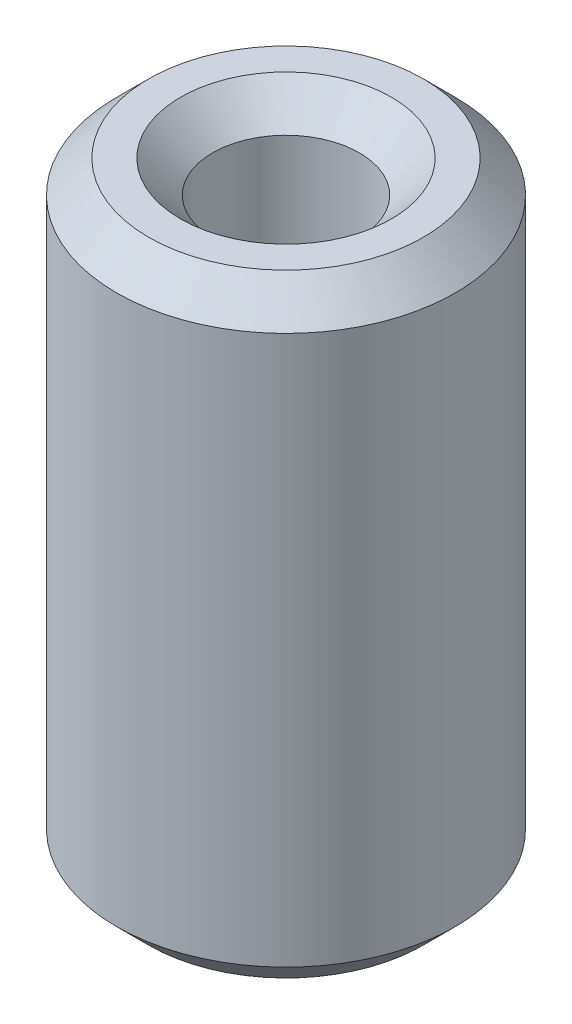
ISO-10303-21;
HEADER;
FILE_DESCRIPTION(('STEP AP214'),'2;1');
FILE_NAME('part.step','',(''),(''),'','','');
FILE_SCHEMA(('AUTOMOTIVE_DESIGN { 1 0 10303 214 1 1 1 1 }'));
ENDSEC;
DATA;
#1=APPLICATION_CONTEXT('core data for automotive mechanical design processes');
#2=APPLICATION_PROTOCOL_DEFINITION('international standard','automotive_design',2000,#1);
#3=PRODUCT_CONTEXT('',#1,'mechanical');
#4=PRODUCT('Part','Part','',(#3));
#5=PRODUCT_RELATED_PRODUCT_CATEGORY('part','',(#4));
#6=PRODUCT_DEFINITION_FORMATION('','',#4);
#7=PRODUCT_DEFINITION_CONTEXT('part definition',#1,'design');
#8=PRODUCT_DEFINITION('design','',#6,#7);
#9=PRODUCT_DEFINITION_SHAPE('','',#8);
#10=(LENGTH_UNIT() NAMED_UNIT(*) SI_UNIT(.MILLI.,.METRE.));
#11=(NAMED_UNIT(*) PLANE_ANGLE_UNIT() SI_UNIT($,.RADIAN.));
#12=(NAMED_UNIT(*) SI_UNIT($,.STERADIAN.) SOLID_ANGLE_UNIT());
#13=UNCERTAINTY_MEASURE_WITH_UNIT(LENGTH_MEASURE(1.E-05),#10,'distance_accuracy_value','');
#14=(GEOMETRIC_REPRESENTATION_CONTEXT(3) GLOBAL_UNCERTAINTY_ASSIGNED_CONTEXT((#13)) GLOBAL_UNIT_ASSIGNED_CONTEXT((#10,
#11,#12)) REPRESENTATION_CONTEXT('',''));
#15=CARTESIAN_POINT('',(0.,0.,0.));
#16=DIRECTION('',(0.,0.,1.));
#17=DIRECTION('',(1.,0.,0.));
#18=AXIS2_PLACEMENT_3D('',#15,#16,#17);
#19=CARTESIAN_POINT('',(0.,63.3334889530982,0.));
#20=DIRECTION('',(0.,-1.,0.));
#21=DIRECTION('',(0.,0.,-1.));
#22=AXIS2_PLACEMENT_3D('',#19,#20,#21);
#23=CYLINDRICAL_SURFACE('',#22,17.5);
#24=CARTESIAN_POINT('',(0.,3.3162561813376,0.));
#25=DIRECTION('',(0.,1.,0.));
#26=DIRECTION('',(0.,0.,1.));
#27=AXIS2_PLACEMENT_3D('',#24,#25,#26);
#28=CIRCLE('',#27,17.5);
#29=CARTESIAN_POINT('',(0.,3.3162561813376,17.5));
#30=VERTEX_POINT('',#29);
#31=EDGE_CURVE('E10',#30,#30,#28,.T.);
#32=ORIENTED_EDGE('',*,*,#31,.T.);
#33=EDGE_LOOP('',(#32));
#34=FACE_BOUND('',#33,.T.);
#35=CARTESIAN_POINT('',(0.,60.0172327717605,0.));
#36=DIRECTION('',(0.,1.,0.));
#37=DIRECTION('',(0.,0.,1.));
#38=AXIS2_PLACEMENT_3D('',#35,#36,#37);
#39=CIRCLE('',#38,17.5);
#40=CARTESIAN_POINT('',(0.,60.0172327717605,17.5));
#41=VERTEX_POINT('',#40);
#42=EDGE_CURVE('E50',#41,#41,#39,.F.);
#43=ORIENTED_EDGE('',*,*,#42,.T.);
#44=EDGE_LOOP('',(#43));
#45=FACE_BOUND('',#44,.T.);
#46=ADVANCED_FACE('F39',(#34,#45),#23,.T.);
#47=CARTESIAN_POINT('',(0.,63.3334889530982,0.));
#48=DIRECTION('',(0.,1.,0.));
#49=DIRECTION('',(0.,0.,1.));
#50=AXIS2_PLACEMENT_3D('',#47,#48,#49);
#51=PLANE('',#50);
#52=CARTESIAN_POINT('',(0.,63.3334889530982,0.));
#53=DIRECTION('',(0.,1.,0.));
#54=DIRECTION('',(0.,0.,1.));
#55=AXIS2_PLACEMENT_3D('',#52,#53,#54);
#56=CIRCLE('',#55,10.8971956554691);
#57=CARTESIAN_POINT('',(0.,63.3334889530982,10.8971956554691));
#58=VERTEX_POINT('',#57);
#59=EDGE_CURVE('E58',#58,#58,#56,.F.);
#60=ORIENTED_EDGE('',*,*,#59,.T.);
#61=EDGE_LOOP('',(#60));
#62=FACE_BOUND('',#61,.T.);
#63=CARTESIAN_POINT('',(0.,63.3334889530982,0.));
#64=DIRECTION('',(0.,1.,0.));
#65=DIRECTION('',(0.,0.,1.));
#66=AXIS2_PLACEMENT_3D('',#63,#64,#65);
#67=CIRCLE('',#66,14.1837438186624);
#68=CARTESIAN_POINT('',(0.,63.3334889530982,14.1837438186624));
#69=VERTEX_POINT('',#68);
#70=EDGE_CURVE('E61',#69,#69,#67,.T.);
#71=ORIENTED_EDGE('',*,*,#70,.T.);
#72=EDGE_LOOP('',(#71));
#73=FACE_BOUND('',#72,.T.);
#74=ADVANCED_FACE('F88',(#62,#73),#51,.T.);
#75=CARTESIAN_POINT('',(0.,0.,0.));
#76=DIRECTION('',(0.,1.,0.));
#77=DIRECTION('',(0.,0.,1.));
#78=AXIS2_PLACEMENT_3D('',#75,#76,#77);
#79=PLANE('',#78);
#80=CARTESIAN_POINT('',(0.,0.,0.));
#81=DIRECTION('',(0.,1.,0.));
#82=DIRECTION('',(0.,0.,1.));
#83=AXIS2_PLACEMENT_3D('',#80,#81,#82);
#84=CIRCLE('',#83,10.8971956554691);
#85=CARTESIAN_POINT('',(0.,0.,10.8971956554691));
#86=VERTEX_POINT('',#85);
#87=EDGE_CURVE('E51',#86,#86,#84,.T.);
#88=ORIENTED_EDGE('',*,*,#87,.T.);
#89=EDGE_LOOP('',(#88));
#90=FACE_BOUND('',#89,.T.);
#91=CARTESIAN_POINT('',(0.,0.,0.));
#92=DIRECTION('',(0.,1.,0.));
#93=DIRECTION('',(0.,0.,1.));
#94=AXIS2_PLACEMENT_3D('',#91,#92,#93);
#95=CIRCLE('',#94,14.1837438186624);
#96=CARTESIAN_POINT('',(0.,0.,14.1837438186624));
#97=VERTEX_POINT('',#96);
#98=EDGE_CURVE('E54',#97,#97,#95,.F.);
#99=ORIENTED_EDGE('',*,*,#98,.T.);
#100=EDGE_LOOP('',(#99));
#101=FACE_BOUND('',#100,.T.);
#102=ADVANCED_FACE('F83',(#90,#101),#79,.F.);
#103=CARTESIAN_POINT('',(0.,63.3334889530982,0.));
#104=DIRECTION('',(0.,-1.,0.));
#105=DIRECTION('',(0.,0.,-1.));
#106=AXIS2_PLACEMENT_3D('',#103,#104,#105);
#107=CYLINDRICAL_SURFACE('',#106,7.58093947413149);
#108=CARTESIAN_POINT('',(0.,60.0172327717605,0.));
#109=DIRECTION('',(0.,1.,0.));
#110=DIRECTION('',(0.,0.,1.));
#111=AXIS2_PLACEMENT_3D('',#108,#109,#110);
#112=CIRCLE('',#111,7.58093947413149);
#113=CARTESIAN_POINT('',(0.,60.0172327717605,7.58093947413149));
#114=VERTEX_POINT('',#113);
#115=EDGE_CURVE('E67',#114,#114,#112,.T.);
#116=ORIENTED_EDGE('',*,*,#115,.T.);
#117=EDGE_LOOP('',(#116));
#118=FACE_BOUND('',#117,.T.);
#119=CARTESIAN_POINT('',(0.,3.31625618133763,0.));
#120=DIRECTION('',(0.,1.,0.));
#121=DIRECTION('',(0.,0.,1.));
#122=AXIS2_PLACEMENT_3D('',#119,#120,#121);
#123=CIRCLE('',#122,7.58093947413149);
#124=CARTESIAN_POINT('',(0.,3.31625618133763,7.58093947413149));
#125=VERTEX_POINT('',#124);
#126=EDGE_CURVE('E69',#125,#125,#123,.F.);
#127=ORIENTED_EDGE('',*,*,#126,.T.);
#128=EDGE_LOOP('',(#127));
#129=FACE_BOUND('',#128,.T.);
#130=ADVANCED_FACE('F71',(#118,#129),#107,.F.);
#131=CARTESIAN_POINT('',(0.,60.0172327717605,0.));
#132=DIRECTION('',(0.,1.,0.));
#133=DIRECTION('',(0.,0.,1.));
#134=AXIS2_PLACEMENT_3D('',#131,#132,#133);
#135=CONICAL_SURFACE('',#134,7.58093947413149,0.785398163397452);
#136=ORIENTED_EDGE('',*,*,#59,.F.);
#137=EDGE_LOOP('',(#136));
#138=FACE_BOUND('',#137,.T.);
#139=ORIENTED_EDGE('',*,*,#115,.F.);
#140=EDGE_LOOP('',(#139));
#141=FACE_BOUND('',#140,.T.);
#142=ADVANCED_FACE('F77',(#138,#141),#135,.F.);
#143=CARTESIAN_POINT('',(0.,0.,0.));
#144=DIRECTION('',(0.,-1.,0.));
#145=DIRECTION('',(0.,0.,-1.));
#146=AXIS2_PLACEMENT_3D('',#143,#144,#145);
#147=CONICAL_SURFACE('',#146,10.8971956554691,0.785398163397446);
#148=ORIENTED_EDGE('',*,*,#126,.F.);
#149=EDGE_LOOP('',(#148));
#150=FACE_BOUND('',#149,.T.);
#151=ORIENTED_EDGE('',*,*,#87,.F.);
#152=EDGE_LOOP('',(#151));
#153=FACE_BOUND('',#152,.T.);
#154=ADVANCED_FACE('F73',(#150,#153),#147,.F.);
#155=CARTESIAN_POINT('',(0.,3.3162561813376,0.));
#156=DIRECTION('',(0.,1.,0.));
#157=DIRECTION('',(0.,0.,1.));
#158=AXIS2_PLACEMENT_3D('',#155,#156,#157);
#159=CONICAL_SURFACE('',#158,17.5,0.785398163397453);
#160=CARTESIAN_POINT('',(0.,0.,14.1837438186624));
#161=CARTESIAN_POINT('',(0.,0.0345443352222662,14.2182881538846));
#162=CARTESIAN_POINT('',(0.,0.0690886704445329,14.2528324891069));
#163=CARTESIAN_POINT('',(0.,0.138177340889066,14.3219211595514));
#164=CARTESIAN_POINT('',(0.,0.172721676111333,14.3564654947737));
#165=CARTESIAN_POINT('',(0.,0.241810346555866,14.4255541652182));
#166=CARTESIAN_POINT('',(0.,0.276354681778133,14.4600985004405));
#167=CARTESIAN_POINT('',(0.,0.345443352222666,14.529187170885));
#168=CARTESIAN_POINT('',(0.,0.379987687444933,14.5637315061073));
#169=CARTESIAN_POINT('',(0.,0.449076357889466,14.6328201765518));
#170=CARTESIAN_POINT('',(0.,0.483620693111733,14.6673645117741));
#171=CARTESIAN_POINT('',(0.,0.552709363556266,14.7364531822186));
#172=CARTESIAN_POINT('',(0.,0.587253698778533,14.7709975174409));
#173=CARTESIAN_POINT('',(0.,0.656342369223066,14.8400861878854));
#174=CARTESIAN_POINT('',(0.,0.690886704445333,14.8746305231077));
#175=CARTESIAN_POINT('',(0.,0.759975374889867,14.9437191935522));
#176=CARTESIAN_POINT('',(0.,0.794519710112133,14.9782635287745));
#177=CARTESIAN_POINT('',(0.,0.863608380556667,15.047352199219));
#178=CARTESIAN_POINT('',(0.,0.898152715778933,15.0818965344413));
#179=CARTESIAN_POINT('',(0.,0.967241386223467,15.1509852048858));
#180=CARTESIAN_POINT('',(0.,1.00178572144573,15.1855295401081));
#181=CARTESIAN_POINT('',(0.,1.07087439189027,15.2546182105526));
#182=CARTESIAN_POINT('',(0.,1.10541872711253,15.2891625457749));
#183=CARTESIAN_POINT('',(0.,1.17450739755707,15.3582512162195));
#184=CARTESIAN_POINT('',(0.,1.20905173277933,15.3927955514417));
#185=CARTESIAN_POINT('',(0.,1.27814040322387,15.4618842218863));
#186=CARTESIAN_POINT('',(0.,1.31268473844613,15.4964285571085));
#187=CARTESIAN_POINT('',(0.,1.38177340889067,15.5655172275531));
#188=CARTESIAN_POINT('',(0.,1.41631774411293,15.6000615627753));
#189=CARTESIAN_POINT('',(0.,1.48540641455747,15.6691502332199));
#190=CARTESIAN_POINT('',(0.,1.51995074977973,15.7036945684421));
#191=CARTESIAN_POINT('',(0.,1.58903942022427,15.7727832388867));
#192=CARTESIAN_POINT('',(0.,1.62358375544653,15.8073275741089));
#193=CARTESIAN_POINT('',(0.,1.69267242589107,15.8764162445535));
#194=CARTESIAN_POINT('',(0.,1.72721676111333,15.9109605797757));
#195=CARTESIAN_POINT('',(0.,1.79630543155787,15.9800492502203));
#196=CARTESIAN_POINT('',(0.,1.83084976678013,16.0145935854425));
#197=CARTESIAN_POINT('',(0.,1.89993843722467,16.0836822558871));
#198=CARTESIAN_POINT('',(0.,1.93448277244693,16.1182265911093));
#199=CARTESIAN_POINT('',(0.,2.00357144289147,16.1873152615539));
#200=CARTESIAN_POINT('',(0.,2.03811577811373,16.2218595967761));
#201=CARTESIAN_POINT('',(0.,2.10720444855827,16.2909482672207));
#202=CARTESIAN_POINT('',(0.,2.14174878378053,16.3254926024429));
#203=CARTESIAN_POINT('',(0.,2.21083745422507,16.3945812728875));
#204=CARTESIAN_POINT('',(0.,2.24538178944733,16.4291256081097));
#205=CARTESIAN_POINT('',(0.,2.31447045989187,16.4982142785543));
#206=CARTESIAN_POINT('',(0.,2.34901479511413,16.5327586137765));
#207=CARTESIAN_POINT('',(0.,2.41810346555867,16.6018472842211));
#208=CARTESIAN_POINT('',(0.,2.45264780078093,16.6363916194433));
#209=CARTESIAN_POINT('',(0.,2.52173647122547,16.7054802898879));
#210=CARTESIAN_POINT('',(0.,2.55628080644773,16.7400246251101));
#211=CARTESIAN_POINT('',(0.,2.62536947689227,16.8091132955547));
#212=CARTESIAN_POINT('',(0.,2.65991381211453,16.8436576307769));
#213=CARTESIAN_POINT('',(0.,2.72900248255907,16.9127463012215));
#214=CARTESIAN_POINT('',(0.,2.76354681778133,16.9472906364437));
#215=CARTESIAN_POINT('',(0.,2.83263548822587,17.0163793068883));
#216=CARTESIAN_POINT('',(0.,2.86717982344813,17.0509236421105));
#217=CARTESIAN_POINT('',(0.,2.93626849389267,17.1200123125551));
#218=CARTESIAN_POINT('',(0.,2.97081282911493,17.1545566477773));
#219=CARTESIAN_POINT('',(0.,3.03990149955947,17.2236453182219));
#220=CARTESIAN_POINT('',(0.,3.07444583478173,17.2581896534441));
#221=CARTESIAN_POINT('',(0.,3.14353450522627,17.3272783238887));
#222=CARTESIAN_POINT('',(0.,3.17807884044853,17.3618226591109));
#223=CARTESIAN_POINT('',(0.,3.24716751089307,17.4309113295555));
#224=CARTESIAN_POINT('',(0.,3.28171184611534,17.4654556647777));
#225=CARTESIAN_POINT('',(0.,3.3162561813376,17.5));
#226=B_SPLINE_CURVE_WITH_KNOTS('',3,(#160,#161,#162,#163,#164,#165,#166,#167,#168,#169,#170,
#171,#172,#173,#174,#175,#176,#177,#178,#179,#180,#181,#182,#183,#184,#185,#186,#187,#188,#189,
#190,#191,#192,#193,#194,#195,#196,#197,#198,#199,#200,#201,#202,#203,#204,#205,#206,#207,#208,
#209,#210,#211,#212,#213,#214,#215,#216,#217,#218,#219,#220,#221,#222,#223,#224,#225),
.UNSPECIFIED.,.F.,.F.,(4,2,2,2,2,2,2,2,2,2,2,2,2,2,2,2,2,2,2,2,2,2,2,2,2,2,2,2,2,2,2,2,4),(0.,
0.146559202123477,0.293118404246954,0.439677606370431,0.586236808493908,0.732796010617385,
0.879355212740862,1.02591441486434,1.17247361698782,1.31903281911129,1.46559202123477,
1.61215122335825,1.75871042548173,1.9052696276052,2.05182882972868,2.19838803185216,
2.34494723397563,2.49150643609911,2.63806563822259,2.78462484034607,2.93118404246954,
3.07774324459302,3.2243024467165,3.37086164883997,3.51742085096345,3.66398005308693,
3.81053925521041,3.95709845733388,4.10365765945736,4.25021686158084,4.39677606370431,
4.54333526582779,4.68989446795127),.UNSPECIFIED.);
#227=EDGE_CURVE('BSEAM76',#97,#30,#226,.T.);
#228=ORIENTED_EDGE('',*,*,#98,.F.);
#229=ORIENTED_EDGE('',*,*,#31,.F.);
#230=ORIENTED_EDGE('',*,*,#227,.T.);
#231=ORIENTED_EDGE('',*,*,#227,.F.);
#232=EDGE_LOOP('',(#228,#230,#229,#231));
#233=FACE_BOUND('',#232,.T.);
#234=ADVANCED_FACE('F76',(#233),#159,.T.);
#235=CARTESIAN_POINT('',(0.,63.3334889530982,0.));
#236=DIRECTION('',(0.,-1.,0.));
#237=DIRECTION('',(0.,0.,-1.));
#238=AXIS2_PLACEMENT_3D('',#235,#236,#237);
#239=CONICAL_SURFACE('',#238,14.1837438186624,0.785398163397445);
#240=ORIENTED_EDGE('',*,*,#42,.F.);
#241=EDGE_LOOP('',(#240));
#242=FACE_BOUND('',#241,.T.);
#243=ORIENTED_EDGE('',*,*,#70,.F.);
#244=EDGE_LOOP('',(#243));
#245=FACE_BOUND('',#244,.T.);
#246=ADVANCED_FACE('F45',(#242,#245),#239,.T.);
#247=CLOSED_SHELL('',(#46,#74,#102,#130,#142,#154,#234,#246));
#248=MANIFOLD_SOLID_BREP('B2',#247);
#249=ADVANCED_BREP_SHAPE_REPRESENTATION('',(#18,#248),#14);
#250=SHAPE_DEFINITION_REPRESENTATION(#9,#249);
ENDSEC;
END-ISO-10303-21;
